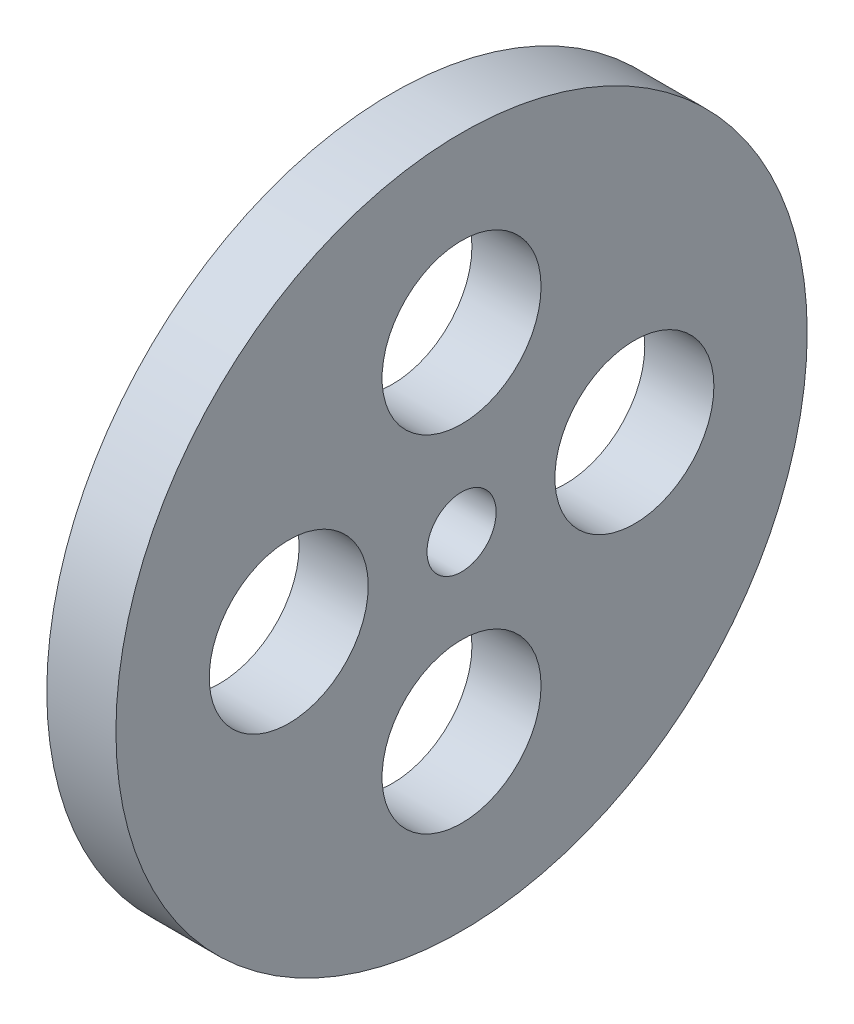
ISO-10303-21;
HEADER;
FILE_DESCRIPTION(('STEP AP214'),'2;1');
FILE_NAME('part.step','',(''),(''),'','','');
FILE_SCHEMA(('AUTOMOTIVE_DESIGN { 1 0 10303 214 1 1 1 1 }'));
ENDSEC;
DATA;
#1=APPLICATION_CONTEXT('core data for automotive mechanical design processes');
#2=APPLICATION_PROTOCOL_DEFINITION('international standard','automotive_design',2000,#1);
#3=PRODUCT_CONTEXT('',#1,'mechanical');
#4=PRODUCT('Part','Part','',(#3));
#5=PRODUCT_RELATED_PRODUCT_CATEGORY('part','',(#4));
#6=PRODUCT_DEFINITION_FORMATION('','',#4);
#7=PRODUCT_DEFINITION_CONTEXT('part definition',#1,'design');
#8=PRODUCT_DEFINITION('design','',#6,#7);
#9=PRODUCT_DEFINITION_SHAPE('','',#8);
#10=(LENGTH_UNIT() NAMED_UNIT(*) SI_UNIT(.MILLI.,.METRE.));
#11=(NAMED_UNIT(*) PLANE_ANGLE_UNIT() SI_UNIT($,.RADIAN.));
#12=(NAMED_UNIT(*) SI_UNIT($,.STERADIAN.) SOLID_ANGLE_UNIT());
#13=UNCERTAINTY_MEASURE_WITH_UNIT(LENGTH_MEASURE(1.E-05),#10,'distance_accuracy_value','');
#14=(GEOMETRIC_REPRESENTATION_CONTEXT(3) GLOBAL_UNCERTAINTY_ASSIGNED_CONTEXT((#13)) GLOBAL_UNIT_ASSIGNED_CONTEXT((#10,
#11,#12)) REPRESENTATION_CONTEXT('',''));
#15=CARTESIAN_POINT('',(0.,0.,0.));
#16=DIRECTION('',(0.,0.,1.));
#17=DIRECTION('',(1.,0.,0.));
#18=AXIS2_PLACEMENT_3D('',#15,#16,#17);
#19=CARTESIAN_POINT('',(10.,0.,0.));
#20=DIRECTION('',(1.,0.,0.));
#21=DIRECTION('',(0.,0.,-1.));
#22=AXIS2_PLACEMENT_3D('',#19,#20,#21);
#23=PLANE('',#22);
#24=CARTESIAN_POINT('',(10.,0.,-25.));
#25=DIRECTION('',(1.,0.,0.));
#26=DIRECTION('',(0.,0.,-1.));
#27=AXIS2_PLACEMENT_3D('',#24,#25,#26);
#28=CIRCLE('',#27,11.5);
#29=CARTESIAN_POINT('',(10.,0.,-36.5));
#30=VERTEX_POINT('',#29);
#31=EDGE_CURVE('E69',#30,#30,#28,.T.);
#32=ORIENTED_EDGE('',*,*,#31,.F.);
#33=EDGE_LOOP('',(#32));
#34=FACE_BOUND('',#33,.T.);
#35=CARTESIAN_POINT('',(10.,0.,25.));
#36=DIRECTION('',(1.,0.,0.));
#37=DIRECTION('',(0.,0.,-1.));
#38=AXIS2_PLACEMENT_3D('',#35,#36,#37);
#39=CIRCLE('',#38,11.5);
#40=CARTESIAN_POINT('',(10.,0.,13.5));
#41=VERTEX_POINT('',#40);
#42=EDGE_CURVE('E57',#41,#41,#39,.T.);
#43=ORIENTED_EDGE('',*,*,#42,.F.);
#44=EDGE_LOOP('',(#43));
#45=FACE_BOUND('',#44,.T.);
#46=CARTESIAN_POINT('',(10.,0.,0.));
#47=DIRECTION('',(1.,0.,0.));
#48=DIRECTION('',(0.,0.,-1.));
#49=AXIS2_PLACEMENT_3D('',#46,#47,#48);
#50=CIRCLE('',#49,50.);
#51=CARTESIAN_POINT('',(10.,0.,-50.));
#52=VERTEX_POINT('',#51);
#53=EDGE_CURVE('E10',#52,#52,#50,.T.);
#54=ORIENTED_EDGE('',*,*,#53,.T.);
#55=EDGE_LOOP('',(#54));
#56=FACE_BOUND('',#55,.T.);
#57=CARTESIAN_POINT('',(10.,0.,0.));
#58=DIRECTION('',(1.,0.,0.));
#59=DIRECTION('',(0.,0.,-1.));
#60=AXIS2_PLACEMENT_3D('',#57,#58,#59);
#61=CIRCLE('',#60,5.);
#62=CARTESIAN_POINT('',(10.,0.,-5.));
#63=VERTEX_POINT('',#62);
#64=EDGE_CURVE('E52',#63,#63,#61,.T.);
#65=ORIENTED_EDGE('',*,*,#64,.F.);
#66=EDGE_LOOP('',(#65));
#67=FACE_BOUND('',#66,.T.);
#68=CARTESIAN_POINT('',(10.,25.,0.));
#69=DIRECTION('',(1.,0.,0.));
#70=DIRECTION('',(0.,0.,-1.));
#71=AXIS2_PLACEMENT_3D('',#68,#69,#70);
#72=CIRCLE('',#71,11.5);
#73=CARTESIAN_POINT('',(10.,25.,-11.5));
#74=VERTEX_POINT('',#73);
#75=EDGE_CURVE('E63',#74,#74,#72,.T.);
#76=ORIENTED_EDGE('',*,*,#75,.F.);
#77=EDGE_LOOP('',(#76));
#78=FACE_BOUND('',#77,.T.);
#79=CARTESIAN_POINT('',(10.,-25.,0.));
#80=DIRECTION('',(1.,0.,0.));
#81=DIRECTION('',(0.,0.,-1.));
#82=AXIS2_PLACEMENT_3D('',#79,#80,#81);
#83=CIRCLE('',#82,11.5);
#84=CARTESIAN_POINT('',(10.,-25.,-11.5));
#85=VERTEX_POINT('',#84);
#86=EDGE_CURVE('E75',#85,#85,#83,.T.);
#87=ORIENTED_EDGE('',*,*,#86,.F.);
#88=EDGE_LOOP('',(#87));
#89=FACE_BOUND('',#88,.T.);
#90=ADVANCED_FACE('F41',(#34,#45,#56,#67,#78,#89),#23,.T.);
#91=CARTESIAN_POINT('',(0.,0.,0.));
#92=DIRECTION('',(1.,0.,0.));
#93=DIRECTION('',(0.,0.,-1.));
#94=AXIS2_PLACEMENT_3D('',#91,#92,#93);
#95=PLANE('',#94);
#96=CARTESIAN_POINT('',(0.,0.,0.));
#97=DIRECTION('',(1.,0.,0.));
#98=DIRECTION('',(0.,0.,-1.));
#99=AXIS2_PLACEMENT_3D('',#96,#97,#98);
#100=CIRCLE('',#99,50.);
#101=CARTESIAN_POINT('',(0.,0.,-50.));
#102=VERTEX_POINT('',#101);
#103=EDGE_CURVE('E45',#102,#102,#100,.T.);
#104=ORIENTED_EDGE('',*,*,#103,.F.);
#105=EDGE_LOOP('',(#104));
#106=FACE_BOUND('',#105,.T.);
#107=CARTESIAN_POINT('',(0.,0.,0.));
#108=DIRECTION('',(1.,0.,0.));
#109=DIRECTION('',(0.,0.,-1.));
#110=AXIS2_PLACEMENT_3D('',#107,#108,#109);
#111=CIRCLE('',#110,5.);
#112=CARTESIAN_POINT('',(0.,0.,-5.));
#113=VERTEX_POINT('',#112);
#114=EDGE_CURVE('E54',#113,#113,#111,.T.);
#115=ORIENTED_EDGE('',*,*,#114,.T.);
#116=EDGE_LOOP('',(#115));
#117=FACE_BOUND('',#116,.T.);
#118=CARTESIAN_POINT('',(0.,0.,25.));
#119=DIRECTION('',(1.,0.,0.));
#120=DIRECTION('',(0.,0.,-1.));
#121=AXIS2_PLACEMENT_3D('',#118,#119,#120);
#122=CIRCLE('',#121,11.5);
#123=CARTESIAN_POINT('',(0.,0.,13.5));
#124=VERTEX_POINT('',#123);
#125=EDGE_CURVE('E60',#124,#124,#122,.T.);
#126=ORIENTED_EDGE('',*,*,#125,.T.);
#127=EDGE_LOOP('',(#126));
#128=FACE_BOUND('',#127,.T.);
#129=CARTESIAN_POINT('',(0.,25.,0.));
#130=DIRECTION('',(1.,0.,0.));
#131=DIRECTION('',(0.,0.,-1.));
#132=AXIS2_PLACEMENT_3D('',#129,#130,#131);
#133=CIRCLE('',#132,11.5);
#134=CARTESIAN_POINT('',(0.,25.,-11.5));
#135=VERTEX_POINT('',#134);
#136=EDGE_CURVE('E66',#135,#135,#133,.T.);
#137=ORIENTED_EDGE('',*,*,#136,.T.);
#138=EDGE_LOOP('',(#137));
#139=FACE_BOUND('',#138,.T.);
#140=CARTESIAN_POINT('',(0.,0.,-25.));
#141=DIRECTION('',(1.,0.,0.));
#142=DIRECTION('',(0.,0.,-1.));
#143=AXIS2_PLACEMENT_3D('',#140,#141,#142);
#144=CIRCLE('',#143,11.5);
#145=CARTESIAN_POINT('',(0.,0.,-36.5));
#146=VERTEX_POINT('',#145);
#147=EDGE_CURVE('E72',#146,#146,#144,.T.);
#148=ORIENTED_EDGE('',*,*,#147,.T.);
#149=EDGE_LOOP('',(#148));
#150=FACE_BOUND('',#149,.T.);
#151=CARTESIAN_POINT('',(0.,-25.,0.));
#152=DIRECTION('',(1.,0.,0.));
#153=DIRECTION('',(0.,0.,-1.));
#154=AXIS2_PLACEMENT_3D('',#151,#152,#153);
#155=CIRCLE('',#154,11.5);
#156=CARTESIAN_POINT('',(0.,-25.,-11.5));
#157=VERTEX_POINT('',#156);
#158=EDGE_CURVE('E78',#157,#157,#155,.T.);
#159=ORIENTED_EDGE('',*,*,#158,.T.);
#160=EDGE_LOOP('',(#159));
#161=FACE_BOUND('',#160,.T.);
#162=ADVANCED_FACE('F88',(#106,#117,#128,#139,#150,#161),#95,.F.);
#163=CARTESIAN_POINT('',(10.,0.,0.));
#164=DIRECTION('',(-1.,0.,0.));
#165=DIRECTION('',(0.,0.,1.));
#166=AXIS2_PLACEMENT_3D('',#163,#164,#165);
#167=CYLINDRICAL_SURFACE('',#166,50.);
#168=ORIENTED_EDGE('',*,*,#53,.F.);
#169=EDGE_LOOP('',(#168));
#170=FACE_BOUND('',#169,.T.);
#171=ORIENTED_EDGE('',*,*,#103,.T.);
#172=EDGE_LOOP('',(#171));
#173=FACE_BOUND('',#172,.T.);
#174=ADVANCED_FACE('F43',(#170,#173),#167,.T.);
#175=CARTESIAN_POINT('',(10.,0.,0.));
#176=DIRECTION('',(-1.,0.,0.));
#177=DIRECTION('',(0.,0.,1.));
#178=AXIS2_PLACEMENT_3D('',#175,#176,#177);
#179=CYLINDRICAL_SURFACE('',#178,5.);
#180=ORIENTED_EDGE('',*,*,#64,.T.);
#181=EDGE_LOOP('',(#180));
#182=FACE_BOUND('',#181,.T.);
#183=ORIENTED_EDGE('',*,*,#114,.F.);
#184=EDGE_LOOP('',(#183));
#185=FACE_BOUND('',#184,.T.);
#186=ADVANCED_FACE('F98',(#182,#185),#179,.F.);
#187=CARTESIAN_POINT('',(10.,0.,25.));
#188=DIRECTION('',(-1.,0.,0.));
#189=DIRECTION('',(0.,0.,1.));
#190=AXIS2_PLACEMENT_3D('',#187,#188,#189);
#191=CYLINDRICAL_SURFACE('',#190,11.5);
#192=ORIENTED_EDGE('',*,*,#42,.T.);
#193=EDGE_LOOP('',(#192));
#194=FACE_BOUND('',#193,.T.);
#195=ORIENTED_EDGE('',*,*,#125,.F.);
#196=EDGE_LOOP('',(#195));
#197=FACE_BOUND('',#196,.T.);
#198=ADVANCED_FACE('F101',(#194,#197),#191,.F.);
#199=CARTESIAN_POINT('',(10.,25.,0.));
#200=DIRECTION('',(-1.,0.,0.));
#201=DIRECTION('',(0.,0.,1.));
#202=AXIS2_PLACEMENT_3D('',#199,#200,#201);
#203=CYLINDRICAL_SURFACE('',#202,11.5);
#204=ORIENTED_EDGE('',*,*,#75,.T.);
#205=EDGE_LOOP('',(#204));
#206=FACE_BOUND('',#205,.T.);
#207=ORIENTED_EDGE('',*,*,#136,.F.);
#208=EDGE_LOOP('',(#207));
#209=FACE_BOUND('',#208,.T.);
#210=ADVANCED_FACE('F105',(#206,#209),#203,.F.);
#211=CARTESIAN_POINT('',(10.,0.,-25.));
#212=DIRECTION('',(-1.,0.,0.));
#213=DIRECTION('',(0.,0.,1.));
#214=AXIS2_PLACEMENT_3D('',#211,#212,#213);
#215=CYLINDRICAL_SURFACE('',#214,11.5);
#216=ORIENTED_EDGE('',*,*,#31,.T.);
#217=EDGE_LOOP('',(#216));
#218=FACE_BOUND('',#217,.T.);
#219=ORIENTED_EDGE('',*,*,#147,.F.);
#220=EDGE_LOOP('',(#219));
#221=FACE_BOUND('',#220,.T.);
#222=ADVANCED_FACE('F109',(#218,#221),#215,.F.);
#223=CARTESIAN_POINT('',(10.,-25.,0.));
#224=DIRECTION('',(-1.,0.,0.));
#225=DIRECTION('',(0.,0.,1.));
#226=AXIS2_PLACEMENT_3D('',#223,#224,#225);
#227=CYLINDRICAL_SURFACE('',#226,11.5);
#228=ORIENTED_EDGE('',*,*,#86,.T.);
#229=EDGE_LOOP('',(#228));
#230=FACE_BOUND('',#229,.T.);
#231=ORIENTED_EDGE('',*,*,#158,.F.);
#232=EDGE_LOOP('',(#231));
#233=FACE_BOUND('',#232,.T.);
#234=ADVANCED_FACE('F84',(#230,#233),#227,.F.);
#235=CLOSED_SHELL('',(#90,#162,#174,#186,#198,#210,#222,#234));
#236=MANIFOLD_SOLID_BREP('B2',#235);
#237=ADVANCED_BREP_SHAPE_REPRESENTATION('',(#18,#236),#14);
#238=SHAPE_DEFINITION_REPRESENTATION(#9,#237);
ENDSEC;
END-ISO-10303-21;
